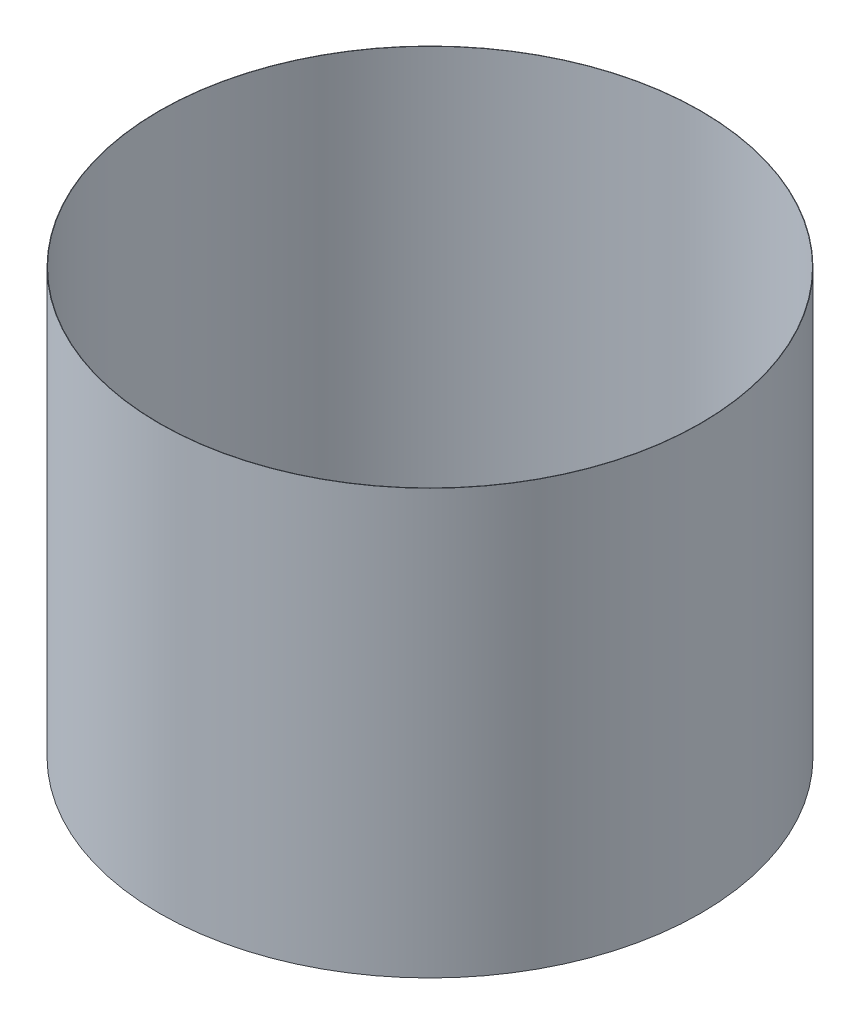
ISO-10303-21;
HEADER;
FILE_DESCRIPTION(('STEP AP214'),'2;1');
FILE_NAME('part.step','',(''),(''),'','','');
FILE_SCHEMA(('AUTOMOTIVE_DESIGN { 1 0 10303 214 1 1 1 1 }'));
ENDSEC;
DATA;
#1=APPLICATION_CONTEXT('core data for automotive mechanical design processes');
#2=APPLICATION_PROTOCOL_DEFINITION('international standard','automotive_design',2000,#1);
#3=PRODUCT_CONTEXT('',#1,'mechanical');
#4=PRODUCT('Part','Part','',(#3));
#5=PRODUCT_RELATED_PRODUCT_CATEGORY('part','',(#4));
#6=PRODUCT_DEFINITION_FORMATION('','',#4);
#7=PRODUCT_DEFINITION_CONTEXT('part definition',#1,'design');
#8=PRODUCT_DEFINITION('design','',#6,#7);
#9=PRODUCT_DEFINITION_SHAPE('','',#8);
#10=(LENGTH_UNIT() NAMED_UNIT(*) SI_UNIT(.MILLI.,.METRE.));
#11=(NAMED_UNIT(*) PLANE_ANGLE_UNIT() SI_UNIT($,.RADIAN.));
#12=(NAMED_UNIT(*) SI_UNIT($,.STERADIAN.) SOLID_ANGLE_UNIT());
#13=UNCERTAINTY_MEASURE_WITH_UNIT(LENGTH_MEASURE(1.E-05),#10,'distance_accuracy_value','');
#14=(GEOMETRIC_REPRESENTATION_CONTEXT(3) GLOBAL_UNCERTAINTY_ASSIGNED_CONTEXT((#13)) GLOBAL_UNIT_ASSIGNED_CONTEXT((#10,
#11,#12)) REPRESENTATION_CONTEXT('',''));
#15=CARTESIAN_POINT('',(0.,0.,0.));
#16=DIRECTION('',(0.,0.,1.));
#17=DIRECTION('',(1.,0.,0.));
#18=AXIS2_PLACEMENT_3D('',#15,#16,#17);
#19=CARTESIAN_POINT('',(0.,400.,0.));
#20=DIRECTION('',(0.,1.,0.));
#21=DIRECTION('',(0.,0.,1.));
#22=AXIS2_PLACEMENT_3D('',#19,#20,#21);
#23=PLANE('',#22);
#24=CARTESIAN_POINT('',(0.,400.,0.));
#25=DIRECTION('',(0.,1.,0.));
#26=DIRECTION('',(0.,0.,1.));
#27=AXIS2_PLACEMENT_3D('',#24,#25,#26);
#28=CIRCLE('',#27,255.42184874);
#29=CARTESIAN_POINT('',(0.,400.,255.42184874));
#30=VERTEX_POINT('',#29);
#31=EDGE_CURVE('E10',#30,#30,#28,.T.);
#32=ORIENTED_EDGE('',*,*,#31,.T.);
#33=EDGE_LOOP('',(#32));
#34=FACE_BOUND('',#33,.T.);
#35=CARTESIAN_POINT('',(0.,400.,0.));
#36=DIRECTION('',(0.,1.,0.));
#37=DIRECTION('',(0.,0.,1.));
#38=AXIS2_PLACEMENT_3D('',#35,#36,#37);
#39=CIRCLE('',#38,255.12184874);
#40=CARTESIAN_POINT('',(0.,400.,255.12184874));
#41=VERTEX_POINT('',#40);
#42=EDGE_CURVE('E44',#41,#41,#39,.T.);
#43=ORIENTED_EDGE('',*,*,#42,.F.);
#44=EDGE_LOOP('',(#43));
#45=FACE_BOUND('',#44,.T.);
#46=ADVANCED_FACE('F33',(#34,#45),#23,.T.);
#47=CARTESIAN_POINT('',(0.,0.,0.));
#48=DIRECTION('',(0.,1.,0.));
#49=DIRECTION('',(0.,0.,1.));
#50=AXIS2_PLACEMENT_3D('',#47,#48,#49);
#51=PLANE('',#50);
#52=CARTESIAN_POINT('',(0.,0.,0.));
#53=DIRECTION('',(0.,1.,0.));
#54=DIRECTION('',(0.,0.,1.));
#55=AXIS2_PLACEMENT_3D('',#52,#53,#54);
#56=CIRCLE('',#55,255.42184874);
#57=CARTESIAN_POINT('',(0.,0.,255.42184874));
#58=VERTEX_POINT('',#57);
#59=EDGE_CURVE('E37',#58,#58,#56,.T.);
#60=ORIENTED_EDGE('',*,*,#59,.F.);
#61=EDGE_LOOP('',(#60));
#62=FACE_BOUND('',#61,.T.);
#63=CARTESIAN_POINT('',(0.,0.,0.));
#64=DIRECTION('',(0.,1.,0.));
#65=DIRECTION('',(0.,0.,1.));
#66=AXIS2_PLACEMENT_3D('',#63,#64,#65);
#67=CIRCLE('',#66,255.12184874);
#68=CARTESIAN_POINT('',(0.,0.,255.12184874));
#69=VERTEX_POINT('',#68);
#70=EDGE_CURVE('E46',#69,#69,#67,.T.);
#71=ORIENTED_EDGE('',*,*,#70,.T.);
#72=EDGE_LOOP('',(#71));
#73=FACE_BOUND('',#72,.T.);
#74=ADVANCED_FACE('F56',(#62,#73),#51,.F.);
#75=CARTESIAN_POINT('',(0.,400.,0.));
#76=DIRECTION('',(0.,-1.,0.));
#77=DIRECTION('',(0.,0.,-1.));
#78=AXIS2_PLACEMENT_3D('',#75,#76,#77);
#79=CYLINDRICAL_SURFACE('',#78,255.42184874);
#80=ORIENTED_EDGE('',*,*,#31,.F.);
#81=EDGE_LOOP('',(#80));
#82=FACE_BOUND('',#81,.T.);
#83=ORIENTED_EDGE('',*,*,#59,.T.);
#84=EDGE_LOOP('',(#83));
#85=FACE_BOUND('',#84,.T.);
#86=ADVANCED_FACE('F35',(#82,#85),#79,.T.);
#87=CARTESIAN_POINT('',(0.,400.,0.));
#88=DIRECTION('',(0.,-1.,0.));
#89=DIRECTION('',(0.,0.,-1.));
#90=AXIS2_PLACEMENT_3D('',#87,#88,#89);
#91=CYLINDRICAL_SURFACE('',#90,255.12184874);
#92=ORIENTED_EDGE('',*,*,#42,.T.);
#93=EDGE_LOOP('',(#92));
#94=FACE_BOUND('',#93,.T.);
#95=ORIENTED_EDGE('',*,*,#70,.F.);
#96=EDGE_LOOP('',(#95));
#97=FACE_BOUND('',#96,.T.);
#98=ADVANCED_FACE('F52',(#94,#97),#91,.F.);
#99=CLOSED_SHELL('',(#46,#74,#86,#98));
#100=MANIFOLD_SOLID_BREP('B2',#99);
#101=ADVANCED_BREP_SHAPE_REPRESENTATION('',(#18,#100),#14);
#102=SHAPE_DEFINITION_REPRESENTATION(#9,#101);
ENDSEC;
END-ISO-10303-21;
